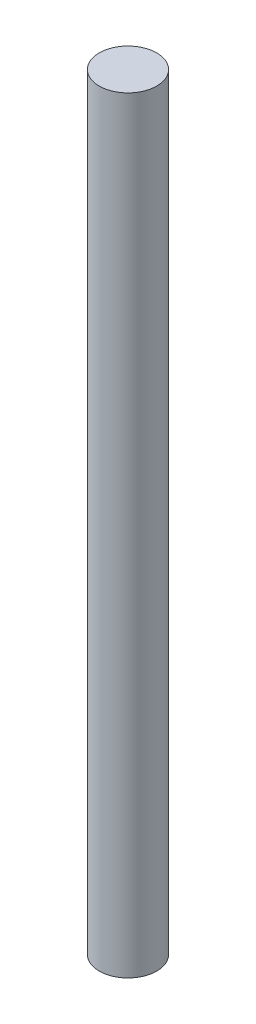
ISO-10303-21;
HEADER;
FILE_DESCRIPTION(('STEP AP214'),'2;1');
FILE_NAME('part.step','',(''),(''),'','','');
FILE_SCHEMA(('AUTOMOTIVE_DESIGN { 1 0 10303 214 1 1 1 1 }'));
ENDSEC;
DATA;
#1=APPLICATION_CONTEXT('core data for automotive mechanical design processes');
#2=APPLICATION_PROTOCOL_DEFINITION('international standard','automotive_design',2000,#1);
#3=PRODUCT_CONTEXT('',#1,'mechanical');
#4=PRODUCT('Part','Part','',(#3));
#5=PRODUCT_RELATED_PRODUCT_CATEGORY('part','',(#4));
#6=PRODUCT_DEFINITION_FORMATION('','',#4);
#7=PRODUCT_DEFINITION_CONTEXT('part definition',#1,'design');
#8=PRODUCT_DEFINITION('design','',#6,#7);
#9=PRODUCT_DEFINITION_SHAPE('','',#8);
#10=(LENGTH_UNIT() NAMED_UNIT(*) SI_UNIT(.MILLI.,.METRE.));
#11=(NAMED_UNIT(*) PLANE_ANGLE_UNIT() SI_UNIT($,.RADIAN.));
#12=(NAMED_UNIT(*) SI_UNIT($,.STERADIAN.) SOLID_ANGLE_UNIT());
#13=UNCERTAINTY_MEASURE_WITH_UNIT(LENGTH_MEASURE(1.E-05),#10,'distance_accuracy_value','');
#14=(GEOMETRIC_REPRESENTATION_CONTEXT(3) GLOBAL_UNCERTAINTY_ASSIGNED_CONTEXT((#13)) GLOBAL_UNIT_ASSIGNED_CONTEXT((#10,
#11,#12)) REPRESENTATION_CONTEXT('',''));
#15=CARTESIAN_POINT('',(0.,0.,0.));
#16=DIRECTION('',(0.,0.,1.));
#17=DIRECTION('',(1.,0.,0.));
#18=AXIS2_PLACEMENT_3D('',#15,#16,#17);
#19=CARTESIAN_POINT('',(0.,20.,0.));
#20=DIRECTION('',(0.,-1.,0.));
#21=DIRECTION('',(0.,0.,-1.));
#22=AXIS2_PLACEMENT_3D('',#19,#20,#21);
#23=CYLINDRICAL_SURFACE('',#22,0.75);
#24=CARTESIAN_POINT('',(0.,20.,0.));
#25=DIRECTION('',(0.,1.,0.));
#26=DIRECTION('',(0.,0.,1.));
#27=AXIS2_PLACEMENT_3D('',#24,#25,#26);
#28=CIRCLE('',#27,0.75);
#29=CARTESIAN_POINT('',(0.,20.,0.75));
#30=VERTEX_POINT('',#29);
#31=EDGE_CURVE('E10',#30,#30,#28,.T.);
#32=ORIENTED_EDGE('',*,*,#31,.F.);
#33=EDGE_LOOP('',(#32));
#34=FACE_BOUND('',#33,.T.);
#35=CARTESIAN_POINT('',(0.,0.,0.));
#36=DIRECTION('',(0.,1.,0.));
#37=DIRECTION('',(0.,0.,1.));
#38=AXIS2_PLACEMENT_3D('',#35,#36,#37);
#39=CIRCLE('',#38,0.75);
#40=CARTESIAN_POINT('',(0.,0.,0.75));
#41=VERTEX_POINT('',#40);
#42=EDGE_CURVE('E40',#41,#41,#39,.T.);
#43=ORIENTED_EDGE('',*,*,#42,.T.);
#44=EDGE_LOOP('',(#43));
#45=FACE_BOUND('',#44,.T.);
#46=ADVANCED_FACE('F37',(#34,#45),#23,.T.);
#47=CARTESIAN_POINT('',(0.,20.,0.));
#48=DIRECTION('',(0.,1.,0.));
#49=DIRECTION('',(0.,0.,1.));
#50=AXIS2_PLACEMENT_3D('',#47,#48,#49);
#51=PLANE('',#50);
#52=ORIENTED_EDGE('',*,*,#31,.T.);
#53=EDGE_LOOP('',(#52));
#54=FACE_BOUND('',#53,.T.);
#55=ADVANCED_FACE('F54',(#54),#51,.T.);
#56=CARTESIAN_POINT('',(0.,0.,0.));
#57=DIRECTION('',(0.,1.,0.));
#58=DIRECTION('',(0.,0.,1.));
#59=AXIS2_PLACEMENT_3D('',#56,#57,#58);
#60=PLANE('',#59);
#61=ORIENTED_EDGE('',*,*,#42,.F.);
#62=EDGE_LOOP('',(#61));
#63=FACE_BOUND('',#62,.T.);
#64=ADVANCED_FACE('F52',(#63),#60,.F.);
#65=CLOSED_SHELL('',(#46,#55,#64));
#66=MANIFOLD_SOLID_BREP('B2',#65);
#67=ADVANCED_BREP_SHAPE_REPRESENTATION('',(#18,#66),#14);
#68=SHAPE_DEFINITION_REPRESENTATION(#9,#67);
ENDSEC;
END-ISO-10303-21;
